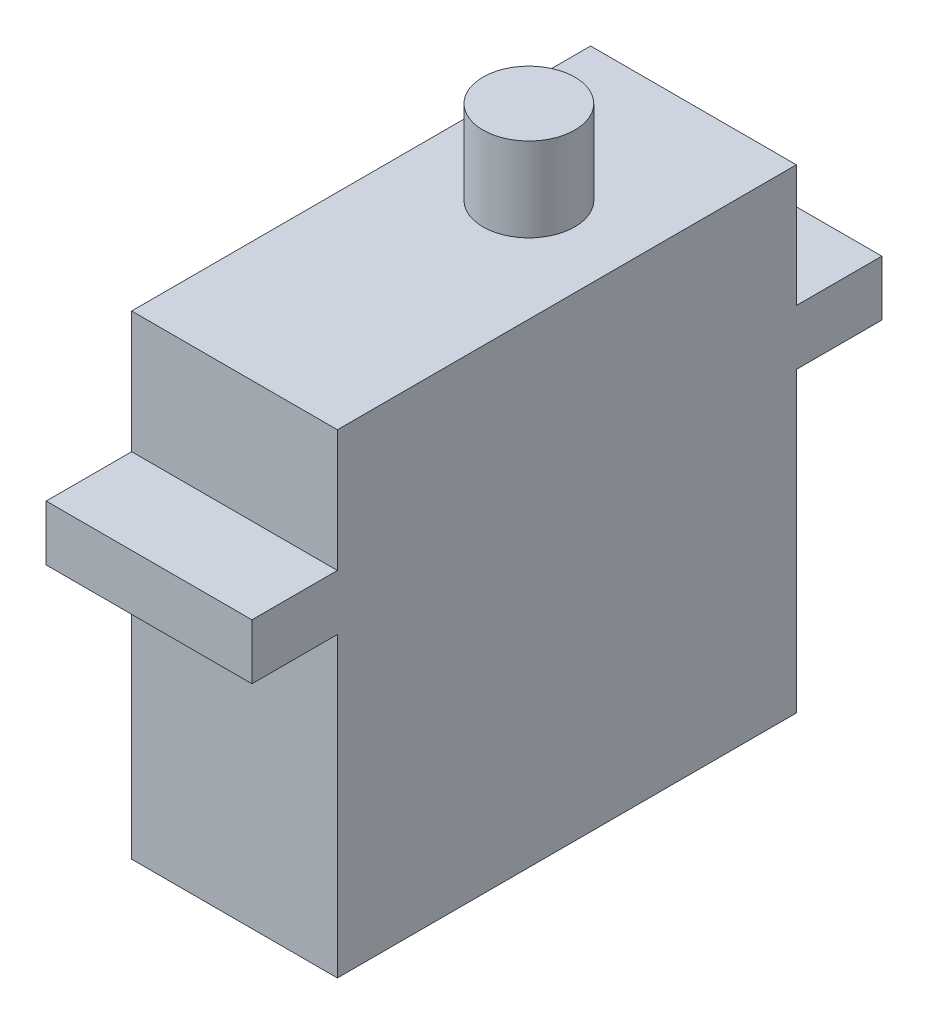
ISO-10303-21;
HEADER;
FILE_DESCRIPTION(('STEP AP214'),'2;1');
FILE_NAME('part.step','',(''),(''),'','','');
FILE_SCHEMA(('AUTOMOTIVE_DESIGN { 1 0 10303 214 1 1 1 1 }'));
ENDSEC;
DATA;
#1=APPLICATION_CONTEXT('core data for automotive mechanical design processes');
#2=APPLICATION_PROTOCOL_DEFINITION('international standard','automotive_design',2000,#1);
#3=PRODUCT_CONTEXT('',#1,'mechanical');
#4=PRODUCT('Part','Part','',(#3));
#5=PRODUCT_RELATED_PRODUCT_CATEGORY('part','',(#4));
#6=PRODUCT_DEFINITION_FORMATION('','',#4);
#7=PRODUCT_DEFINITION_CONTEXT('part definition',#1,'design');
#8=PRODUCT_DEFINITION('design','',#6,#7);
#9=PRODUCT_DEFINITION_SHAPE('','',#8);
#10=(LENGTH_UNIT() NAMED_UNIT(*) SI_UNIT(.MILLI.,.METRE.));
#11=(NAMED_UNIT(*) PLANE_ANGLE_UNIT() SI_UNIT($,.RADIAN.));
#12=(NAMED_UNIT(*) SI_UNIT($,.STERADIAN.) SOLID_ANGLE_UNIT());
#13=UNCERTAINTY_MEASURE_WITH_UNIT(LENGTH_MEASURE(1.E-05),#10,'distance_accuracy_value','');
#14=(GEOMETRIC_REPRESENTATION_CONTEXT(3) GLOBAL_UNCERTAINTY_ASSIGNED_CONTEXT((#13)) GLOBAL_UNIT_ASSIGNED_CONTEXT((#10,
#11,#12)) REPRESENTATION_CONTEXT('',''));
#15=CARTESIAN_POINT('',(0.,0.,0.));
#16=DIRECTION('',(0.,0.,1.));
#17=DIRECTION('',(1.,0.,0.));
#18=AXIS2_PLACEMENT_3D('',#15,#16,#17);
#19=CARTESIAN_POINT('',(13.,0.,0.));
#20=DIRECTION('',(1.,0.,0.));
#21=DIRECTION('',(0.,0.,-1.));
#22=AXIS2_PLACEMENT_3D('',#19,#20,#21);
#23=PLANE('',#22);
#24=DIRECTION('',(0.,0.,-1.));
#25=VECTOR('',#24,1.);
#26=CARTESIAN_POINT('',(13.,15.,0.));
#27=LINE('',#26,#25);
#28=CARTESIAN_POINT('',(13.,15.,14.5));
#29=VERTEX_POINT('',#28);
#30=CARTESIAN_POINT('',(13.,15.,-14.5));
#31=VERTEX_POINT('',#30);
#32=EDGE_CURVE('E214',#29,#31,#27,.T.);
#33=ORIENTED_EDGE('',*,*,#32,.F.);
#34=DIRECTION('',(0.,-1.,0.));
#35=VECTOR('',#34,1.);
#36=CARTESIAN_POINT('',(13.,0.,14.5));
#37=LINE('',#36,#35);
#38=CARTESIAN_POINT('',(13.,7.30000000000001,14.5));
#39=VERTEX_POINT('',#38);
#40=EDGE_CURVE('E205',#29,#39,#37,.T.);
#41=ORIENTED_EDGE('',*,*,#40,.T.);
#42=DIRECTION('',(0.,0.,1.));
#43=VECTOR('',#42,1.);
#44=CARTESIAN_POINT('',(13.,7.29999999999999,0.));
#45=LINE('',#44,#43);
#46=CARTESIAN_POINT('',(13.,7.30000000000001,19.9));
#47=VERTEX_POINT('',#46);
#48=EDGE_CURVE('E281',#39,#47,#45,.T.);
#49=ORIENTED_EDGE('',*,*,#48,.T.);
#50=DIRECTION('',(0.,-1.,0.));
#51=VECTOR('',#50,1.);
#52=CARTESIAN_POINT('',(13.,0.,19.9));
#53=LINE('',#52,#51);
#54=CARTESIAN_POINT('',(13.,3.80000000000001,19.9));
#55=VERTEX_POINT('',#54);
#56=EDGE_CURVE('E277',#47,#55,#53,.T.);
#57=ORIENTED_EDGE('',*,*,#56,.T.);
#58=DIRECTION('',(0.,0.,1.));
#59=VECTOR('',#58,1.);
#60=CARTESIAN_POINT('',(13.,3.80000000000003,0.));
#61=LINE('',#60,#59);
#62=CARTESIAN_POINT('',(13.,3.80000000000002,14.5));
#63=VERTEX_POINT('',#62);
#64=EDGE_CURVE('E271',#63,#55,#61,.T.);
#65=ORIENTED_EDGE('',*,*,#64,.F.);
#66=CARTESIAN_POINT('',(13.,-15.,14.5));
#67=VERTEX_POINT('',#66);
#68=EDGE_CURVE('E266',#63,#67,#37,.T.);
#69=ORIENTED_EDGE('',*,*,#68,.T.);
#70=DIRECTION('',(0.,0.,-1.));
#71=VECTOR('',#70,1.);
#72=CARTESIAN_POINT('',(13.,-15.,0.));
#73=LINE('',#72,#71);
#74=CARTESIAN_POINT('',(13.,-15.,-14.5));
#75=VERTEX_POINT('',#74);
#76=EDGE_CURVE('E263',#67,#75,#73,.T.);
#77=ORIENTED_EDGE('',*,*,#76,.T.);
#78=DIRECTION('',(0.,-1.,0.));
#79=VECTOR('',#78,1.);
#80=CARTESIAN_POINT('',(13.,0.,-14.5));
#81=LINE('',#80,#79);
#82=CARTESIAN_POINT('',(13.,3.80000000000002,-14.5));
#83=VERTEX_POINT('',#82);
#84=EDGE_CURVE('E137',#83,#75,#81,.T.);
#85=ORIENTED_EDGE('',*,*,#84,.F.);
#86=DIRECTION('',(0.,0.,-1.));
#87=VECTOR('',#86,1.);
#88=CARTESIAN_POINT('',(13.,3.80000000000003,0.));
#89=LINE('',#88,#87);
#90=CARTESIAN_POINT('',(13.,3.80000000000001,-19.9));
#91=VERTEX_POINT('',#90);
#92=EDGE_CURVE('E131',#83,#91,#89,.T.);
#93=ORIENTED_EDGE('',*,*,#92,.T.);
#94=DIRECTION('',(0.,-1.,0.));
#95=VECTOR('',#94,1.);
#96=CARTESIAN_POINT('',(13.,0.,-19.9));
#97=LINE('',#96,#95);
#98=CARTESIAN_POINT('',(13.,7.30000000000001,-19.9));
#99=VERTEX_POINT('',#98);
#100=EDGE_CURVE('E135',#99,#91,#97,.T.);
#101=ORIENTED_EDGE('',*,*,#100,.F.);
#102=DIRECTION('',(0.,0.,-1.));
#103=VECTOR('',#102,1.);
#104=CARTESIAN_POINT('',(13.,7.29999999999999,0.));
#105=LINE('',#104,#103);
#106=CARTESIAN_POINT('',(13.,7.30000000000001,-14.5));
#107=VERTEX_POINT('',#106);
#108=EDGE_CURVE('E150',#107,#99,#105,.T.);
#109=ORIENTED_EDGE('',*,*,#108,.F.);
#110=EDGE_CURVE('E181',#31,#107,#81,.T.);
#111=ORIENTED_EDGE('',*,*,#110,.F.);
#112=EDGE_LOOP('',(#33,#41,#49,#57,#65,#69,#77,#85,#93,#101,#109,#111));
#113=FACE_BOUND('',#112,.T.);
#114=ADVANCED_FACE('F38',(#113),#23,.T.);
#115=CARTESIAN_POINT('',(13.,20.3,0.));
#116=DIRECTION('',(0.,1.,0.));
#117=DIRECTION('',(0.,0.,1.));
#118=AXIS2_PLACEMENT_3D('',#115,#116,#117);
#119=PLANE('',#118);
#120=CARTESIAN_POINT('',(6.5,20.3,-4.1));
#121=DIRECTION('',(0.,1.,0.));
#122=DIRECTION('',(0.,0.,1.));
#123=AXIS2_PLACEMENT_3D('',#120,#121,#122);
#124=CIRCLE('',#123,2.9);
#125=CARTESIAN_POINT('',(6.5,20.3,-1.2));
#126=VERTEX_POINT('',#125);
#127=EDGE_CURVE('E158',#126,#126,#124,.T.);
#128=ORIENTED_EDGE('',*,*,#127,.T.);
#129=EDGE_LOOP('',(#128));
#130=FACE_BOUND('',#129,.T.);
#131=ADVANCED_FACE('F40',(#130),#119,.T.);
#132=CARTESIAN_POINT('',(0.,0.,0.));
#133=DIRECTION('',(1.,0.,0.));
#134=DIRECTION('',(0.,0.,-1.));
#135=AXIS2_PLACEMENT_3D('',#132,#133,#134);
#136=PLANE('',#135);
#137=DIRECTION('',(0.,0.,-1.));
#138=VECTOR('',#137,1.);
#139=CARTESIAN_POINT('',(0.,15.,0.));
#140=LINE('',#139,#138);
#141=CARTESIAN_POINT('',(0.,15.,14.5));
#142=VERTEX_POINT('',#141);
#143=CARTESIAN_POINT('',(0.,15.,-14.5));
#144=VERTEX_POINT('',#143);
#145=EDGE_CURVE('E157',#142,#144,#140,.T.);
#146=ORIENTED_EDGE('',*,*,#145,.T.);
#147=DIRECTION('',(0.,-1.,0.));
#148=VECTOR('',#147,1.);
#149=CARTESIAN_POINT('',(0.,0.,-14.5));
#150=LINE('',#149,#148);
#151=CARTESIAN_POINT('',(0.,7.30000000000001,-14.5));
#152=VERTEX_POINT('',#151);
#153=EDGE_CURVE('E155',#144,#152,#150,.T.);
#154=ORIENTED_EDGE('',*,*,#153,.T.);
#155=DIRECTION('',(0.,0.,-1.));
#156=VECTOR('',#155,1.);
#157=CARTESIAN_POINT('',(0.,7.29999999999999,0.));
#158=LINE('',#157,#156);
#159=CARTESIAN_POINT('',(0.,7.30000000000001,-19.9));
#160=VERTEX_POINT('',#159);
#161=EDGE_CURVE('E178',#152,#160,#158,.T.);
#162=ORIENTED_EDGE('',*,*,#161,.T.);
#163=DIRECTION('',(0.,-1.,0.));
#164=VECTOR('',#163,1.);
#165=CARTESIAN_POINT('',(0.,0.,-19.9));
#166=LINE('',#165,#164);
#167=CARTESIAN_POINT('',(0.,3.80000000000001,-19.9));
#168=VERTEX_POINT('',#167);
#169=EDGE_CURVE('E176',#160,#168,#166,.T.);
#170=ORIENTED_EDGE('',*,*,#169,.T.);
#171=DIRECTION('',(0.,0.,-1.));
#172=VECTOR('',#171,1.);
#173=CARTESIAN_POINT('',(0.,3.80000000000003,0.));
#174=LINE('',#173,#172);
#175=CARTESIAN_POINT('',(0.,3.80000000000002,-14.5));
#176=VERTEX_POINT('',#175);
#177=EDGE_CURVE('E144',#176,#168,#174,.T.);
#178=ORIENTED_EDGE('',*,*,#177,.F.);
#179=CARTESIAN_POINT('',(0.,-15.,-14.5));
#180=VERTEX_POINT('',#179);
#181=EDGE_CURVE('E159',#176,#180,#150,.T.);
#182=ORIENTED_EDGE('',*,*,#181,.T.);
#183=DIRECTION('',(0.,0.,-1.));
#184=VECTOR('',#183,1.);
#185=CARTESIAN_POINT('',(0.,-15.,0.));
#186=LINE('',#185,#184);
#187=CARTESIAN_POINT('',(0.,-15.,14.5));
#188=VERTEX_POINT('',#187);
#189=EDGE_CURVE('E172',#188,#180,#186,.T.);
#190=ORIENTED_EDGE('',*,*,#189,.F.);
#191=DIRECTION('',(0.,-1.,0.));
#192=VECTOR('',#191,1.);
#193=CARTESIAN_POINT('',(0.,0.,14.5));
#194=LINE('',#193,#192);
#195=CARTESIAN_POINT('',(0.,3.80000000000002,14.5));
#196=VERTEX_POINT('',#195);
#197=EDGE_CURVE('E164',#196,#188,#194,.T.);
#198=ORIENTED_EDGE('',*,*,#197,.F.);
#199=DIRECTION('',(0.,0.,1.));
#200=VECTOR('',#199,1.);
#201=CARTESIAN_POINT('',(0.,3.80000000000003,0.));
#202=LINE('',#201,#200);
#203=CARTESIAN_POINT('',(0.,3.80000000000001,19.9));
#204=VERTEX_POINT('',#203);
#205=EDGE_CURVE('E169',#196,#204,#202,.T.);
#206=ORIENTED_EDGE('',*,*,#205,.T.);
#207=DIRECTION('',(0.,-1.,0.));
#208=VECTOR('',#207,1.);
#209=CARTESIAN_POINT('',(0.,0.,19.9));
#210=LINE('',#209,#208);
#211=CARTESIAN_POINT('',(0.,7.30000000000001,19.9));
#212=VERTEX_POINT('',#211);
#213=EDGE_CURVE('E166',#212,#204,#210,.T.);
#214=ORIENTED_EDGE('',*,*,#213,.F.);
#215=DIRECTION('',(0.,0.,1.));
#216=VECTOR('',#215,1.);
#217=CARTESIAN_POINT('',(0.,7.29999999999999,0.));
#218=LINE('',#217,#216);
#219=CARTESIAN_POINT('',(0.,7.30000000000001,14.5));
#220=VERTEX_POINT('',#219);
#221=EDGE_CURVE('E163',#220,#212,#218,.T.);
#222=ORIENTED_EDGE('',*,*,#221,.F.);
#223=EDGE_CURVE('E161',#142,#220,#194,.T.);
#224=ORIENTED_EDGE('',*,*,#223,.F.);
#225=EDGE_LOOP('',(#146,#154,#162,#170,#178,#182,#190,#198,#206,#214,#222,#224));
#226=FACE_BOUND('',#225,.T.);
#227=ADVANCED_FACE('F211',(#226),#136,.F.);
#228=CARTESIAN_POINT('',(13.,0.,-14.5));
#229=DIRECTION('',(0.,0.,-1.));
#230=DIRECTION('',(0.,1.,0.));
#231=AXIS2_PLACEMENT_3D('',#228,#229,#230);
#232=PLANE('',#231);
#233=ORIENTED_EDGE('',*,*,#153,.F.);
#234=DIRECTION('',(-1.,0.,0.));
#235=VECTOR('',#234,1.);
#236=CARTESIAN_POINT('',(13.,15.,-14.5));
#237=LINE('',#236,#235);
#238=EDGE_CURVE('E11',#31,#144,#237,.T.);
#239=ORIENTED_EDGE('',*,*,#238,.F.);
#240=ORIENTED_EDGE('',*,*,#110,.T.);
#241=DIRECTION('',(-1.,0.,0.));
#242=VECTOR('',#241,1.);
#243=CARTESIAN_POINT('',(13.,7.30000000000001,-14.5));
#244=LINE('',#243,#242);
#245=EDGE_CURVE('E55',#107,#152,#244,.T.);
#246=ORIENTED_EDGE('',*,*,#245,.T.);
#247=EDGE_LOOP('',(#233,#239,#240,#246));
#248=FACE_BOUND('',#247,.T.);
#249=ADVANCED_FACE('F215',(#248),#232,.T.);
#250=CARTESIAN_POINT('',(13.,15.,0.));
#251=DIRECTION('',(0.,1.,0.));
#252=DIRECTION('',(0.,0.,1.));
#253=AXIS2_PLACEMENT_3D('',#250,#251,#252);
#254=PLANE('',#253);
#255=CARTESIAN_POINT('',(6.5,15.,-4.1));
#256=DIRECTION('',(0.,1.,0.));
#257=DIRECTION('',(0.,0.,1.));
#258=AXIS2_PLACEMENT_3D('',#255,#256,#257);
#259=CIRCLE('',#258,2.9);
#260=CARTESIAN_POINT('',(6.5,15.,-1.2));
#261=VERTEX_POINT('',#260);
#262=EDGE_CURVE('E291',#261,#261,#259,.T.);
#263=ORIENTED_EDGE('',*,*,#262,.F.);
#264=EDGE_LOOP('',(#263));
#265=FACE_BOUND('',#264,.T.);
#266=ORIENTED_EDGE('',*,*,#145,.F.);
#267=DIRECTION('',(-1.,0.,0.));
#268=VECTOR('',#267,1.);
#269=CARTESIAN_POINT('',(13.,15.,14.5));
#270=LINE('',#269,#268);
#271=EDGE_CURVE('E47',#29,#142,#270,.T.);
#272=ORIENTED_EDGE('',*,*,#271,.F.);
#273=ORIENTED_EDGE('',*,*,#32,.T.);
#274=ORIENTED_EDGE('',*,*,#238,.T.);
#275=EDGE_LOOP('',(#266,#272,#273,#274));
#276=FACE_BOUND('',#275,.T.);
#277=ADVANCED_FACE('F213',(#265,#276),#254,.T.);
#278=CARTESIAN_POINT('',(13.,0.,14.5));
#279=DIRECTION('',(0.,0.,-1.));
#280=DIRECTION('',(0.,1.,0.));
#281=AXIS2_PLACEMENT_3D('',#278,#279,#280);
#282=PLANE('',#281);
#283=ORIENTED_EDGE('',*,*,#223,.T.);
#284=DIRECTION('',(-1.,0.,0.));
#285=VECTOR('',#284,1.);
#286=CARTESIAN_POINT('',(13.,7.30000000000001,14.5));
#287=LINE('',#286,#285);
#288=EDGE_CURVE('E197',#39,#220,#287,.T.);
#289=ORIENTED_EDGE('',*,*,#288,.F.);
#290=ORIENTED_EDGE('',*,*,#40,.F.);
#291=ORIENTED_EDGE('',*,*,#271,.T.);
#292=EDGE_LOOP('',(#283,#289,#290,#291));
#293=FACE_BOUND('',#292,.T.);
#294=ADVANCED_FACE('F203',(#293),#282,.F.);
#295=CARTESIAN_POINT('',(13.,7.29999999999999,0.));
#296=DIRECTION('',(0.,-1.,0.));
#297=DIRECTION('',(0.,0.,-1.));
#298=AXIS2_PLACEMENT_3D('',#295,#296,#297);
#299=PLANE('',#298);
#300=ORIENTED_EDGE('',*,*,#221,.T.);
#301=DIRECTION('',(-1.,0.,0.));
#302=VECTOR('',#301,1.);
#303=CARTESIAN_POINT('',(13.,7.30000000000001,19.9));
#304=LINE('',#303,#302);
#305=EDGE_CURVE('E194',#47,#212,#304,.T.);
#306=ORIENTED_EDGE('',*,*,#305,.F.);
#307=ORIENTED_EDGE('',*,*,#48,.F.);
#308=ORIENTED_EDGE('',*,*,#288,.T.);
#309=EDGE_LOOP('',(#300,#306,#307,#308));
#310=FACE_BOUND('',#309,.T.);
#311=ADVANCED_FACE('F280',(#310),#299,.F.);
#312=CARTESIAN_POINT('',(13.,0.,19.9));
#313=DIRECTION('',(0.,0.,-1.));
#314=DIRECTION('',(-1.,0.,0.));
#315=AXIS2_PLACEMENT_3D('',#312,#313,#314);
#316=PLANE('',#315);
#317=ORIENTED_EDGE('',*,*,#213,.T.);
#318=DIRECTION('',(-1.,0.,0.));
#319=VECTOR('',#318,1.);
#320=CARTESIAN_POINT('',(13.,3.80000000000001,19.9));
#321=LINE('',#320,#319);
#322=EDGE_CURVE('E192',#55,#204,#321,.T.);
#323=ORIENTED_EDGE('',*,*,#322,.F.);
#324=ORIENTED_EDGE('',*,*,#56,.F.);
#325=ORIENTED_EDGE('',*,*,#305,.T.);
#326=EDGE_LOOP('',(#317,#323,#324,#325));
#327=FACE_BOUND('',#326,.T.);
#328=ADVANCED_FACE('F274',(#327),#316,.F.);
#329=CARTESIAN_POINT('',(13.,3.80000000000003,0.));
#330=DIRECTION('',(0.,-1.,0.));
#331=DIRECTION('',(0.,0.,-1.));
#332=AXIS2_PLACEMENT_3D('',#329,#330,#331);
#333=PLANE('',#332);
#334=ORIENTED_EDGE('',*,*,#205,.F.);
#335=DIRECTION('',(-1.,0.,0.));
#336=VECTOR('',#335,1.);
#337=CARTESIAN_POINT('',(13.,3.80000000000002,14.5));
#338=LINE('',#337,#336);
#339=EDGE_CURVE('E190',#63,#196,#338,.T.);
#340=ORIENTED_EDGE('',*,*,#339,.F.);
#341=ORIENTED_EDGE('',*,*,#64,.T.);
#342=ORIENTED_EDGE('',*,*,#322,.T.);
#343=EDGE_LOOP('',(#334,#340,#341,#342));
#344=FACE_BOUND('',#343,.T.);
#345=ADVANCED_FACE('F270',(#344),#333,.T.);
#346=ORIENTED_EDGE('',*,*,#197,.T.);
#347=DIRECTION('',(-1.,0.,0.));
#348=VECTOR('',#347,1.);
#349=CARTESIAN_POINT('',(13.,-15.,14.5));
#350=LINE('',#349,#348);
#351=EDGE_CURVE('E187',#67,#188,#350,.T.);
#352=ORIENTED_EDGE('',*,*,#351,.F.);
#353=ORIENTED_EDGE('',*,*,#68,.F.);
#354=ORIENTED_EDGE('',*,*,#339,.T.);
#355=EDGE_LOOP('',(#346,#352,#353,#354));
#356=FACE_BOUND('',#355,.T.);
#357=ADVANCED_FACE('F253',(#356),#282,.F.);
#358=CARTESIAN_POINT('',(13.,-15.,0.));
#359=DIRECTION('',(0.,1.,0.));
#360=DIRECTION('',(0.,0.,1.));
#361=AXIS2_PLACEMENT_3D('',#358,#359,#360);
#362=PLANE('',#361);
#363=ORIENTED_EDGE('',*,*,#189,.T.);
#364=DIRECTION('',(-1.,0.,0.));
#365=VECTOR('',#364,1.);
#366=CARTESIAN_POINT('',(13.,-15.,-14.5));
#367=LINE('',#366,#365);
#368=EDGE_CURVE('E185',#75,#180,#367,.T.);
#369=ORIENTED_EDGE('',*,*,#368,.F.);
#370=ORIENTED_EDGE('',*,*,#76,.F.);
#371=ORIENTED_EDGE('',*,*,#351,.T.);
#372=EDGE_LOOP('',(#363,#369,#370,#371));
#373=FACE_BOUND('',#372,.T.);
#374=ADVANCED_FACE('F247',(#373),#362,.F.);
#375=ORIENTED_EDGE('',*,*,#181,.F.);
#376=DIRECTION('',(-1.,0.,0.));
#377=VECTOR('',#376,1.);
#378=CARTESIAN_POINT('',(13.,3.80000000000002,-14.5));
#379=LINE('',#378,#377);
#380=EDGE_CURVE('E147',#83,#176,#379,.T.);
#381=ORIENTED_EDGE('',*,*,#380,.F.);
#382=ORIENTED_EDGE('',*,*,#84,.T.);
#383=ORIENTED_EDGE('',*,*,#368,.T.);
#384=EDGE_LOOP('',(#375,#381,#382,#383));
#385=FACE_BOUND('',#384,.T.);
#386=ADVANCED_FACE('F239',(#385),#232,.T.);
#387=CARTESIAN_POINT('',(13.,3.80000000000003,0.));
#388=DIRECTION('',(0.,1.,0.));
#389=DIRECTION('',(0.,0.,1.));
#390=AXIS2_PLACEMENT_3D('',#387,#388,#389);
#391=PLANE('',#390);
#392=ORIENTED_EDGE('',*,*,#177,.T.);
#393=DIRECTION('',(-1.,0.,0.));
#394=VECTOR('',#393,1.);
#395=CARTESIAN_POINT('',(13.,3.80000000000001,-19.9));
#396=LINE('',#395,#394);
#397=EDGE_CURVE('E141',#91,#168,#396,.T.);
#398=ORIENTED_EDGE('',*,*,#397,.F.);
#399=ORIENTED_EDGE('',*,*,#92,.F.);
#400=ORIENTED_EDGE('',*,*,#380,.T.);
#401=EDGE_LOOP('',(#392,#398,#399,#400));
#402=FACE_BOUND('',#401,.T.);
#403=ADVANCED_FACE('F142',(#402),#391,.F.);
#404=CARTESIAN_POINT('',(13.,0.,-19.9));
#405=DIRECTION('',(0.,0.,-1.));
#406=DIRECTION('',(-1.,0.,0.));
#407=AXIS2_PLACEMENT_3D('',#404,#405,#406);
#408=PLANE('',#407);
#409=ORIENTED_EDGE('',*,*,#169,.F.);
#410=DIRECTION('',(-1.,0.,0.));
#411=VECTOR('',#410,1.);
#412=CARTESIAN_POINT('',(13.,7.30000000000001,-19.9));
#413=LINE('',#412,#411);
#414=EDGE_CURVE('E93',#99,#160,#413,.T.);
#415=ORIENTED_EDGE('',*,*,#414,.F.);
#416=ORIENTED_EDGE('',*,*,#100,.T.);
#417=ORIENTED_EDGE('',*,*,#397,.T.);
#418=EDGE_LOOP('',(#409,#415,#416,#417));
#419=FACE_BOUND('',#418,.T.);
#420=ADVANCED_FACE('F149',(#419),#408,.T.);
#421=CARTESIAN_POINT('',(13.,7.29999999999999,0.));
#422=DIRECTION('',(0.,1.,0.));
#423=DIRECTION('',(0.,0.,1.));
#424=AXIS2_PLACEMENT_3D('',#421,#422,#423);
#425=PLANE('',#424);
#426=ORIENTED_EDGE('',*,*,#161,.F.);
#427=ORIENTED_EDGE('',*,*,#245,.F.);
#428=ORIENTED_EDGE('',*,*,#108,.T.);
#429=ORIENTED_EDGE('',*,*,#414,.T.);
#430=EDGE_LOOP('',(#426,#427,#428,#429));
#431=FACE_BOUND('',#430,.T.);
#432=ADVANCED_FACE('F216',(#431),#425,.T.);
#433=CARTESIAN_POINT('',(6.5,29.0114866699089,-4.1));
#434=DIRECTION('',(0.,-1.,0.));
#435=DIRECTION('',(0.,0.,-1.));
#436=AXIS2_PLACEMENT_3D('',#433,#434,#435);
#437=CYLINDRICAL_SURFACE('',#436,2.9);
#438=ORIENTED_EDGE('',*,*,#262,.T.);
#439=EDGE_LOOP('',(#438));
#440=FACE_BOUND('',#439,.T.);
#441=ORIENTED_EDGE('',*,*,#127,.F.);
#442=EDGE_LOOP('',(#441));
#443=FACE_BOUND('',#442,.T.);
#444=ADVANCED_FACE('F218',(#440,#443),#437,.T.);
#445=CLOSED_SHELL('',(#114,#131,#227,#249,#277,#294,#311,#328,#345,#357,#374,#386,#403,#420,
#432,#444));
#446=MANIFOLD_SOLID_BREP('B2',#445);
#447=ADVANCED_BREP_SHAPE_REPRESENTATION('',(#18,#446),#14);
#448=SHAPE_DEFINITION_REPRESENTATION(#9,#447);
ENDSEC;
END-ISO-10303-21;
